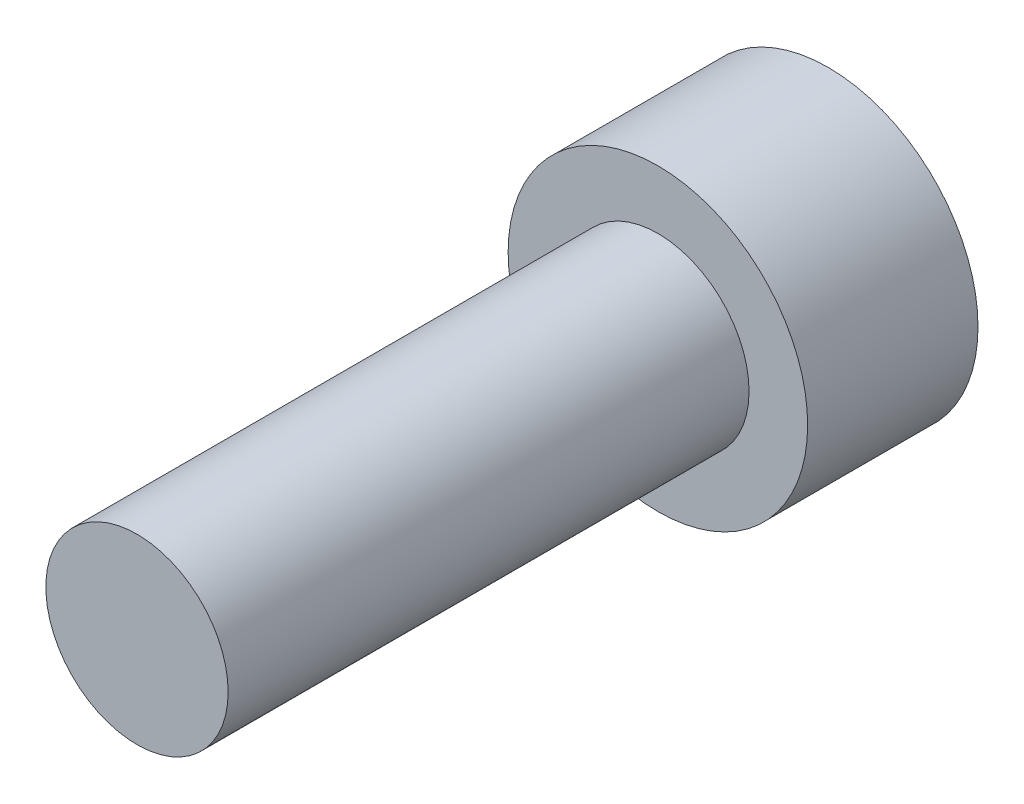
ISO-10303-21;
HEADER;
FILE_DESCRIPTION(('STEP AP214'),'2;1');
FILE_NAME('part.step','',(''),(''),'','','');
FILE_SCHEMA(('AUTOMOTIVE_DESIGN { 1 0 10303 214 1 1 1 1 }'));
ENDSEC;
DATA;
#1=APPLICATION_CONTEXT('core data for automotive mechanical design processes');
#2=APPLICATION_PROTOCOL_DEFINITION('international standard','automotive_design',2000,#1);
#3=PRODUCT_CONTEXT('',#1,'mechanical');
#4=PRODUCT('Part','Part','',(#3));
#5=PRODUCT_RELATED_PRODUCT_CATEGORY('part','',(#4));
#6=PRODUCT_DEFINITION_FORMATION('','',#4);
#7=PRODUCT_DEFINITION_CONTEXT('part definition',#1,'design');
#8=PRODUCT_DEFINITION('design','',#6,#7);
#9=PRODUCT_DEFINITION_SHAPE('','',#8);
#10=(LENGTH_UNIT() NAMED_UNIT(*) SI_UNIT(.MILLI.,.METRE.));
#11=(NAMED_UNIT(*) PLANE_ANGLE_UNIT() SI_UNIT($,.RADIAN.));
#12=(NAMED_UNIT(*) SI_UNIT($,.STERADIAN.) SOLID_ANGLE_UNIT());
#13=UNCERTAINTY_MEASURE_WITH_UNIT(LENGTH_MEASURE(1.E-05),#10,'distance_accuracy_value','');
#14=(GEOMETRIC_REPRESENTATION_CONTEXT(3) GLOBAL_UNCERTAINTY_ASSIGNED_CONTEXT((#13)) GLOBAL_UNIT_ASSIGNED_CONTEXT((#10,
#11,#12)) REPRESENTATION_CONTEXT('',''));
#15=CARTESIAN_POINT('',(0.,0.,0.));
#16=DIRECTION('',(0.,0.,1.));
#17=DIRECTION('',(1.,0.,0.));
#18=AXIS2_PLACEMENT_3D('',#15,#16,#17);
#19=CARTESIAN_POINT('',(0.,0.,3.27));
#20=DIRECTION('',(0.,0.,-1.));
#21=DIRECTION('',(-1.,0.,0.));
#22=AXIS2_PLACEMENT_3D('',#19,#20,#21);
#23=CYLINDRICAL_SURFACE('',#22,2.875);
#24=CARTESIAN_POINT('',(0.,0.,3.27));
#25=DIRECTION('',(0.,0.,1.));
#26=DIRECTION('',(1.,0.,0.));
#27=AXIS2_PLACEMENT_3D('',#24,#25,#26);
#28=CIRCLE('',#27,2.875);
#29=CARTESIAN_POINT('',(2.875,0.,3.27));
#30=VERTEX_POINT('',#29);
#31=EDGE_CURVE('E43',#30,#30,#28,.T.);
#32=ORIENTED_EDGE('',*,*,#31,.F.);
#33=EDGE_LOOP('',(#32));
#34=FACE_BOUND('',#33,.T.);
#35=CARTESIAN_POINT('',(0.,0.,0.));
#36=DIRECTION('',(0.,0.,1.));
#37=DIRECTION('',(1.,0.,0.));
#38=AXIS2_PLACEMENT_3D('',#35,#36,#37);
#39=CIRCLE('',#38,2.875);
#40=CARTESIAN_POINT('',(2.875,0.,0.));
#41=VERTEX_POINT('',#40);
#42=EDGE_CURVE('E39',#41,#41,#39,.T.);
#43=ORIENTED_EDGE('',*,*,#42,.T.);
#44=EDGE_LOOP('',(#43));
#45=FACE_BOUND('',#44,.T.);
#46=ADVANCED_FACE('F36',(#34,#45),#23,.T.);
#47=CARTESIAN_POINT('',(0.,0.,3.27));
#48=DIRECTION('',(0.,0.,1.));
#49=DIRECTION('',(1.,0.,0.));
#50=AXIS2_PLACEMENT_3D('',#47,#48,#49);
#51=PLANE('',#50);
#52=CARTESIAN_POINT('',(0.,0.,3.27));
#53=DIRECTION('',(0.,0.,1.));
#54=DIRECTION('',(1.,0.,0.));
#55=AXIS2_PLACEMENT_3D('',#52,#53,#54);
#56=CIRCLE('',#55,1.75);
#57=CARTESIAN_POINT('',(1.75,0.,3.27));
#58=VERTEX_POINT('',#57);
#59=EDGE_CURVE('E10',#58,#58,#56,.T.);
#60=ORIENTED_EDGE('',*,*,#59,.F.);
#61=EDGE_LOOP('',(#60));
#62=FACE_BOUND('',#61,.T.);
#63=ORIENTED_EDGE('',*,*,#31,.T.);
#64=EDGE_LOOP('',(#63));
#65=FACE_BOUND('',#64,.T.);
#66=ADVANCED_FACE('F60',(#62,#65),#51,.T.);
#67=CARTESIAN_POINT('',(0.,0.,0.));
#68=DIRECTION('',(0.,0.,1.));
#69=DIRECTION('',(1.,0.,0.));
#70=AXIS2_PLACEMENT_3D('',#67,#68,#69);
#71=PLANE('',#70);
#72=ORIENTED_EDGE('',*,*,#42,.F.);
#73=EDGE_LOOP('',(#72));
#74=FACE_BOUND('',#73,.T.);
#75=ADVANCED_FACE('F57',(#74),#71,.F.);
#76=CARTESIAN_POINT('',(0.,0.,13.27));
#77=DIRECTION('',(0.,0.,-1.));
#78=DIRECTION('',(-1.,0.,0.));
#79=AXIS2_PLACEMENT_3D('',#76,#77,#78);
#80=CYLINDRICAL_SURFACE('',#79,1.75);
#81=CARTESIAN_POINT('',(0.,0.,13.27));
#82=DIRECTION('',(0.,0.,1.));
#83=DIRECTION('',(1.,0.,0.));
#84=AXIS2_PLACEMENT_3D('',#81,#82,#83);
#85=CIRCLE('',#84,1.75);
#86=CARTESIAN_POINT('',(1.75,0.,13.27));
#87=VERTEX_POINT('',#86);
#88=EDGE_CURVE('E49',#87,#87,#85,.T.);
#89=ORIENTED_EDGE('',*,*,#88,.F.);
#90=EDGE_LOOP('',(#89));
#91=FACE_BOUND('',#90,.T.);
#92=ORIENTED_EDGE('',*,*,#59,.T.);
#93=EDGE_LOOP('',(#92));
#94=FACE_BOUND('',#93,.T.);
#95=ADVANCED_FACE('F59',(#91,#94),#80,.T.);
#96=CARTESIAN_POINT('',(0.,0.,13.27));
#97=DIRECTION('',(0.,0.,1.));
#98=DIRECTION('',(1.,0.,0.));
#99=AXIS2_PLACEMENT_3D('',#96,#97,#98);
#100=PLANE('',#99);
#101=ORIENTED_EDGE('',*,*,#88,.T.);
#102=EDGE_LOOP('',(#101));
#103=FACE_BOUND('',#102,.T.);
#104=ADVANCED_FACE('F65',(#103),#100,.T.);
#105=CLOSED_SHELL('',(#46,#66,#75,#95,#104));
#106=MANIFOLD_SOLID_BREP('B2',#105);
#107=ADVANCED_BREP_SHAPE_REPRESENTATION('',(#18,#106),#14);
#108=SHAPE_DEFINITION_REPRESENTATION(#9,#107);
ENDSEC;
END-ISO-10303-21;
